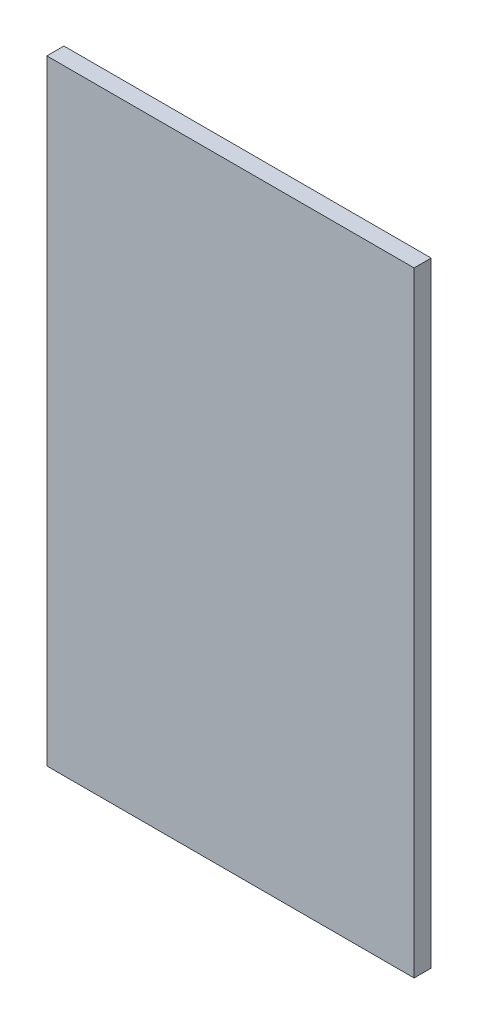
ISO-10303-21;
HEADER;
FILE_DESCRIPTION(('STEP AP214'),'2;1');
FILE_NAME('part.step','',(''),(''),'','','');
FILE_SCHEMA(('AUTOMOTIVE_DESIGN { 1 0 10303 214 1 1 1 1 }'));
ENDSEC;
DATA;
#1=APPLICATION_CONTEXT('core data for automotive mechanical design processes');
#2=APPLICATION_PROTOCOL_DEFINITION('international standard','automotive_design',2000,#1);
#3=PRODUCT_CONTEXT('',#1,'mechanical');
#4=PRODUCT('Part','Part','',(#3));
#5=PRODUCT_RELATED_PRODUCT_CATEGORY('part','',(#4));
#6=PRODUCT_DEFINITION_FORMATION('','',#4);
#7=PRODUCT_DEFINITION_CONTEXT('part definition',#1,'design');
#8=PRODUCT_DEFINITION('design','',#6,#7);
#9=PRODUCT_DEFINITION_SHAPE('','',#8);
#10=(LENGTH_UNIT() NAMED_UNIT(*) SI_UNIT(.MILLI.,.METRE.));
#11=(NAMED_UNIT(*) PLANE_ANGLE_UNIT() SI_UNIT($,.RADIAN.));
#12=(NAMED_UNIT(*) SI_UNIT($,.STERADIAN.) SOLID_ANGLE_UNIT());
#13=UNCERTAINTY_MEASURE_WITH_UNIT(LENGTH_MEASURE(1.E-05),#10,'distance_accuracy_value','');
#14=(GEOMETRIC_REPRESENTATION_CONTEXT(3) GLOBAL_UNCERTAINTY_ASSIGNED_CONTEXT((#13)) GLOBAL_UNIT_ASSIGNED_CONTEXT((#10,
#11,#12)) REPRESENTATION_CONTEXT('',''));
#15=CARTESIAN_POINT('',(0.,0.,0.));
#16=DIRECTION('',(0.,0.,1.));
#17=DIRECTION('',(1.,0.,0.));
#18=AXIS2_PLACEMENT_3D('',#15,#16,#17);
#19=CARTESIAN_POINT('',(65.0875,-114.3,5.55625));
#20=DIRECTION('',(1.,0.,0.));
#21=DIRECTION('',(0.,0.,-1.));
#22=AXIS2_PLACEMENT_3D('',#19,#20,#21);
#23=PLANE('',#22);
#24=DIRECTION('',(0.,1.,0.));
#25=VECTOR('',#24,1.);
#26=CARTESIAN_POINT('',(65.0875,-114.3,-0.79375));
#27=LINE('',#26,#25);
#28=CARTESIAN_POINT('',(65.0875,-114.3,-0.79375));
#29=VERTEX_POINT('',#28);
#30=CARTESIAN_POINT('',(65.0875,114.3,-0.79375));
#31=VERTEX_POINT('',#30);
#32=EDGE_CURVE('E42',#29,#31,#27,.T.);
#33=ORIENTED_EDGE('',*,*,#32,.T.);
#34=DIRECTION('',(0.,0.,-1.));
#35=VECTOR('',#34,1.);
#36=CARTESIAN_POINT('',(65.0875,114.3,5.55625));
#37=LINE('',#36,#35);
#38=CARTESIAN_POINT('',(65.0875,114.3,5.55625));
#39=VERTEX_POINT('',#38);
#40=EDGE_CURVE('E80',#39,#31,#37,.T.);
#41=ORIENTED_EDGE('',*,*,#40,.F.);
#42=DIRECTION('',(0.,1.,0.));
#43=VECTOR('',#42,1.);
#44=CARTESIAN_POINT('',(65.0875,-114.3,5.55625));
#45=LINE('',#44,#43);
#46=CARTESIAN_POINT('',(65.0875,-114.3,5.55625));
#47=VERTEX_POINT('',#46);
#48=EDGE_CURVE('E11',#47,#39,#45,.T.);
#49=ORIENTED_EDGE('',*,*,#48,.F.);
#50=DIRECTION('',(0.,0.,-1.));
#51=VECTOR('',#50,1.);
#52=CARTESIAN_POINT('',(65.0875,-114.3,5.55625));
#53=LINE('',#52,#51);
#54=EDGE_CURVE('E81',#47,#29,#53,.T.);
#55=ORIENTED_EDGE('',*,*,#54,.T.);
#56=EDGE_LOOP('',(#33,#41,#49,#55));
#57=FACE_BOUND('',#56,.T.);
#58=ADVANCED_FACE('F39',(#57),#23,.T.);
#59=CARTESIAN_POINT('',(-71.4375,-114.3,5.55625));
#60=DIRECTION('',(0.,0.,1.));
#61=DIRECTION('',(1.,0.,0.));
#62=AXIS2_PLACEMENT_3D('',#59,#60,#61);
#63=PLANE('',#62);
#64=ORIENTED_EDGE('',*,*,#48,.T.);
#65=DIRECTION('',(1.,0.,0.));
#66=VECTOR('',#65,1.);
#67=CARTESIAN_POINT('',(-71.4375,114.3,5.55625));
#68=LINE('',#67,#66);
#69=CARTESIAN_POINT('',(-71.4375,114.3,5.55625));
#70=VERTEX_POINT('',#69);
#71=EDGE_CURVE('E99',#70,#39,#68,.T.);
#72=ORIENTED_EDGE('',*,*,#71,.F.);
#73=DIRECTION('',(0.,1.,0.));
#74=VECTOR('',#73,1.);
#75=CARTESIAN_POINT('',(-71.4375,-114.3,5.55625));
#76=LINE('',#75,#74);
#77=CARTESIAN_POINT('',(-71.4375,-114.3,5.55625));
#78=VERTEX_POINT('',#77);
#79=EDGE_CURVE('E48',#78,#70,#76,.T.);
#80=ORIENTED_EDGE('',*,*,#79,.F.);
#81=DIRECTION('',(1.,0.,0.));
#82=VECTOR('',#81,1.);
#83=CARTESIAN_POINT('',(-71.4375,-114.3,5.55625));
#84=LINE('',#83,#82);
#85=EDGE_CURVE('E87',#78,#47,#84,.T.);
#86=ORIENTED_EDGE('',*,*,#85,.T.);
#87=EDGE_LOOP('',(#64,#72,#80,#86));
#88=FACE_BOUND('',#87,.T.);
#89=ADVANCED_FACE('F123',(#88),#63,.T.);
#90=CARTESIAN_POINT('',(-71.4375,-114.3,5.55625));
#91=DIRECTION('',(-1.,0.,0.));
#92=DIRECTION('',(0.,0.,1.));
#93=AXIS2_PLACEMENT_3D('',#90,#91,#92);
#94=PLANE('',#93);
#95=ORIENTED_EDGE('',*,*,#79,.T.);
#96=DIRECTION('',(0.,0.,1.));
#97=VECTOR('',#96,1.);
#98=CARTESIAN_POINT('',(-71.4375,114.3,5.55625));
#99=LINE('',#98,#97);
#100=CARTESIAN_POINT('',(-71.4375,114.3,-0.79375));
#101=VERTEX_POINT('',#100);
#102=EDGE_CURVE('E95',#101,#70,#99,.T.);
#103=ORIENTED_EDGE('',*,*,#102,.F.);
#104=DIRECTION('',(0.,1.,0.));
#105=VECTOR('',#104,1.);
#106=CARTESIAN_POINT('',(-71.4375,-114.3,-0.79375));
#107=LINE('',#106,#105);
#108=CARTESIAN_POINT('',(-71.4375,-114.3,-0.79375));
#109=VERTEX_POINT('',#108);
#110=EDGE_CURVE('E86',#109,#101,#107,.T.);
#111=ORIENTED_EDGE('',*,*,#110,.F.);
#112=DIRECTION('',(0.,0.,1.));
#113=VECTOR('',#112,1.);
#114=CARTESIAN_POINT('',(-71.4375,-114.3,5.55625));
#115=LINE('',#114,#113);
#116=EDGE_CURVE('E112',#109,#78,#115,.T.);
#117=ORIENTED_EDGE('',*,*,#116,.T.);
#118=EDGE_LOOP('',(#95,#103,#111,#117));
#119=FACE_BOUND('',#118,.T.);
#120=ADVANCED_FACE('F120',(#119),#94,.T.);
#121=CARTESIAN_POINT('',(-71.4375,-114.3,-0.79375));
#122=DIRECTION('',(0.,0.,-1.));
#123=DIRECTION('',(-1.,0.,0.));
#124=AXIS2_PLACEMENT_3D('',#121,#122,#123);
#125=PLANE('',#124);
#126=ORIENTED_EDGE('',*,*,#110,.T.);
#127=DIRECTION('',(-1.,0.,0.));
#128=VECTOR('',#127,1.);
#129=CARTESIAN_POINT('',(-71.4375,114.3,-0.79375));
#130=LINE('',#129,#128);
#131=EDGE_CURVE('E89',#31,#101,#130,.T.);
#132=ORIENTED_EDGE('',*,*,#131,.F.);
#133=ORIENTED_EDGE('',*,*,#32,.F.);
#134=DIRECTION('',(-1.,0.,0.));
#135=VECTOR('',#134,1.);
#136=CARTESIAN_POINT('',(-71.4375,-114.3,-0.79375));
#137=LINE('',#136,#135);
#138=EDGE_CURVE('E109',#29,#109,#137,.T.);
#139=ORIENTED_EDGE('',*,*,#138,.T.);
#140=EDGE_LOOP('',(#126,#132,#133,#139));
#141=FACE_BOUND('',#140,.T.);
#142=ADVANCED_FACE('F90',(#141),#125,.T.);
#143=CARTESIAN_POINT('',(0.,-114.3,0.));
#144=DIRECTION('',(0.,-1.,0.));
#145=DIRECTION('',(0.,0.,-1.));
#146=AXIS2_PLACEMENT_3D('',#143,#144,#145);
#147=PLANE('',#146);
#148=ORIENTED_EDGE('',*,*,#54,.F.);
#149=ORIENTED_EDGE('',*,*,#85,.F.);
#150=ORIENTED_EDGE('',*,*,#116,.F.);
#151=ORIENTED_EDGE('',*,*,#138,.F.);
#152=EDGE_LOOP('',(#148,#149,#150,#151));
#153=FACE_BOUND('',#152,.T.);
#154=ADVANCED_FACE('F125',(#153),#147,.T.);
#155=CARTESIAN_POINT('',(0.,114.3,0.));
#156=DIRECTION('',(0.,-1.,0.));
#157=DIRECTION('',(0.,0.,-1.));
#158=AXIS2_PLACEMENT_3D('',#155,#156,#157);
#159=PLANE('',#158);
#160=ORIENTED_EDGE('',*,*,#40,.T.);
#161=ORIENTED_EDGE('',*,*,#131,.T.);
#162=ORIENTED_EDGE('',*,*,#102,.T.);
#163=ORIENTED_EDGE('',*,*,#71,.T.);
#164=EDGE_LOOP('',(#160,#161,#162,#163));
#165=FACE_BOUND('',#164,.T.);
#166=ADVANCED_FACE('F98',(#165),#159,.F.);
#167=CLOSED_SHELL('',(#58,#89,#120,#142,#154,#166));
#168=MANIFOLD_SOLID_BREP('B2',#167);
#169=ADVANCED_BREP_SHAPE_REPRESENTATION('',(#18,#168),#14);
#170=SHAPE_DEFINITION_REPRESENTATION(#9,#169);
ENDSEC;
END-ISO-10303-21;
